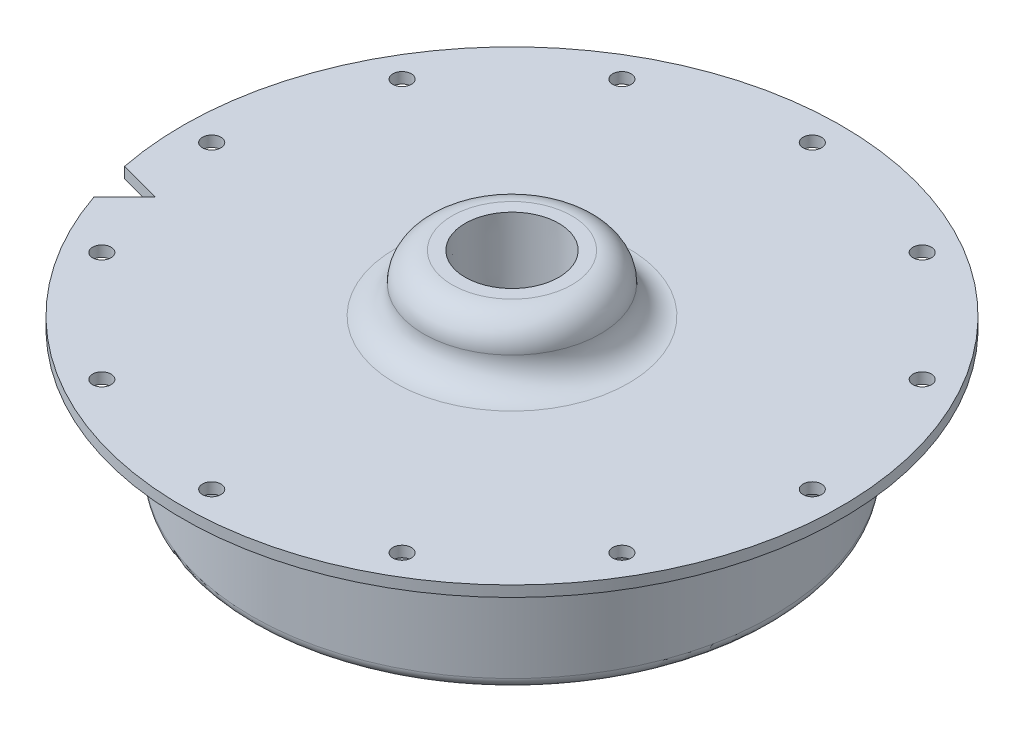
ISO-10303-21;
HEADER;
FILE_DESCRIPTION(('STEP AP214'),'2;1');
FILE_NAME('part.step','',(''),(''),'','','');
FILE_SCHEMA(('AUTOMOTIVE_DESIGN { 1 0 10303 214 1 1 1 1 }'));
ENDSEC;
DATA;
#1=APPLICATION_CONTEXT('core data for automotive mechanical design processes');
#2=APPLICATION_PROTOCOL_DEFINITION('international standard','automotive_design',2000,#1);
#3=PRODUCT_CONTEXT('',#1,'mechanical');
#4=PRODUCT('Part','Part','',(#3));
#5=PRODUCT_RELATED_PRODUCT_CATEGORY('part','',(#4));
#6=PRODUCT_DEFINITION_FORMATION('','',#4);
#7=PRODUCT_DEFINITION_CONTEXT('part definition',#1,'design');
#8=PRODUCT_DEFINITION('design','',#6,#7);
#9=PRODUCT_DEFINITION_SHAPE('','',#8);
#10=(LENGTH_UNIT() NAMED_UNIT(*) SI_UNIT(.MILLI.,.METRE.));
#11=(NAMED_UNIT(*) PLANE_ANGLE_UNIT() SI_UNIT($,.RADIAN.));
#12=(NAMED_UNIT(*) SI_UNIT($,.STERADIAN.) SOLID_ANGLE_UNIT());
#13=UNCERTAINTY_MEASURE_WITH_UNIT(LENGTH_MEASURE(1.E-05),#10,'distance_accuracy_value','');
#14=(GEOMETRIC_REPRESENTATION_CONTEXT(3) GLOBAL_UNCERTAINTY_ASSIGNED_CONTEXT((#13)) GLOBAL_UNIT_ASSIGNED_CONTEXT((#10,
#11,#12)) REPRESENTATION_CONTEXT('',''));
#15=CARTESIAN_POINT('',(0.,0.,0.));
#16=DIRECTION('',(0.,0.,1.));
#17=DIRECTION('',(1.,0.,0.));
#18=AXIS2_PLACEMENT_3D('',#15,#16,#17);
#19=CARTESIAN_POINT('',(0.,55.,0.));
#20=DIRECTION('',(0.,1.,0.));
#21=DIRECTION('',(0.,0.,1.));
#22=AXIS2_PLACEMENT_3D('',#19,#20,#21);
#23=CYLINDRICAL_SURFACE('',#22,48.26);
#24=DIRECTION('',(0.,1.,0.));
#25=VECTOR('',#24,1.);
#26=CARTESIAN_POINT('',(-47.3363393913495,-8.67426131403117,9.39673203975569));
#27=LINE('',#26,#25);
#28=CARTESIAN_POINT('',(-47.3363393913495,0.,9.39673203975569));
#29=VERTEX_POINT('',#28);
#30=CARTESIAN_POINT('',(-47.3363393913495,1.5875,9.39673203975569));
#31=VERTEX_POINT('',#30);
#32=EDGE_CURVE('E67',#29,#31,#27,.T.);
#33=ORIENTED_EDGE('',*,*,#32,.T.);
#34=CARTESIAN_POINT('',(0.,1.5875,0.));
#35=DIRECTION('',(0.,1.,0.));
#36=DIRECTION('',(0.,0.,1.));
#37=AXIS2_PLACEMENT_3D('',#34,#35,#36);
#38=CIRCLE('',#37,48.26);
#39=CARTESIAN_POINT('',(-45.6928384549485,1.5875,15.5303610366912));
#40=VERTEX_POINT('',#39);
#41=EDGE_CURVE('E82',#40,#31,#38,.T.);
#42=ORIENTED_EDGE('',*,*,#41,.F.);
#43=DIRECTION('',(0.,1.,0.));
#44=VECTOR('',#43,1.);
#45=CARTESIAN_POINT('',(-45.6928384549485,-8.67426131403117,15.5303610366912));
#46=LINE('',#45,#44);
#47=CARTESIAN_POINT('',(-45.6928384549485,0.,15.5303610366912));
#48=VERTEX_POINT('',#47);
#49=EDGE_CURVE('E47',#48,#40,#46,.T.);
#50=ORIENTED_EDGE('',*,*,#49,.F.);
#51=CARTESIAN_POINT('',(0.,0.,0.));
#52=DIRECTION('',(0.,1.,0.));
#53=DIRECTION('',(0.,0.,1.));
#54=AXIS2_PLACEMENT_3D('',#51,#52,#53);
#55=CIRCLE('',#54,48.26);
#56=EDGE_CURVE('E11',#48,#29,#55,.T.);
#57=ORIENTED_EDGE('',*,*,#56,.T.);
#58=EDGE_LOOP('',(#33,#42,#50,#57));
#59=FACE_BOUND('',#58,.T.);
#60=ADVANCED_FACE('F33',(#59),#23,.T.);
#61=CARTESIAN_POINT('',(-48.26,0.,0.));
#62=DIRECTION('',(0.,-1.,0.));
#63=DIRECTION('',(0.,0.,-1.));
#64=AXIS2_PLACEMENT_3D('',#61,#62,#63);
#65=PLANE('',#64);
#66=DIRECTION('',(-0.965925826289069,0.,-0.258819045102518));
#67=VECTOR('',#66,1.);
#68=CARTESIAN_POINT('',(-5.52011648807824,0.,20.6013551972069));
#69=LINE('',#68,#67);
#70=CARTESIAN_POINT('',(-41.2027103944139,0.,11.0402329761567));
#71=VERTEX_POINT('',#70);
#72=EDGE_CURVE('E65',#71,#29,#69,.T.);
#73=ORIENTED_EDGE('',*,*,#72,.T.);
#74=ORIENTED_EDGE('',*,*,#56,.F.);
#75=DIRECTION('',(0.707106781186549,0.,-0.707106781186547));
#76=VECTOR('',#75,1.);
#77=CARTESIAN_POINT('',(-15.0812387091286,0.,-15.0812387091286));
#78=LINE('',#77,#76);
#79=EDGE_CURVE('E80',#48,#71,#78,.T.);
#80=ORIENTED_EDGE('',*,*,#79,.T.);
#81=EDGE_LOOP('',(#73,#74,#80));
#82=FACE_BOUND('',#81,.T.);
#83=CARTESIAN_POINT('',(-38.0823845996807,0.,-21.9868749999744));
#84=DIRECTION('',(0.,-1.,0.));
#85=DIRECTION('',(0.,0.,-1.));
#86=AXIS2_PLACEMENT_3D('',#83,#84,#85);
#87=CIRCLE('',#86,1.35254999999999);
#88=CARTESIAN_POINT('',(-38.0823845996807,0.,-23.3394249999744));
#89=VERTEX_POINT('',#88);
#90=EDGE_CURVE('E96',#89,#89,#87,.T.);
#91=ORIENTED_EDGE('',*,*,#90,.F.);
#92=EDGE_LOOP('',(#91));
#93=FACE_BOUND('',#92,.T.);
#94=CARTESIAN_POINT('',(-21.9868750000255,0.,-38.0823845996512));
#95=DIRECTION('',(0.,-1.,0.));
#96=DIRECTION('',(0.,0.,-1.));
#97=AXIS2_PLACEMENT_3D('',#94,#95,#96);
#98=CIRCLE('',#97,1.35254999999999);
#99=CARTESIAN_POINT('',(-21.9868750000255,0.,-39.4349345996512));
#100=VERTEX_POINT('',#99);
#101=EDGE_CURVE('E102',#100,#100,#98,.T.);
#102=ORIENTED_EDGE('',*,*,#101,.F.);
#103=EDGE_LOOP('',(#102));
#104=FACE_BOUND('',#103,.T.);
#105=CARTESIAN_POINT('',(-2.94188747273289E-11,0.,-43.97375));
#106=DIRECTION('',(0.,-1.,0.));
#107=DIRECTION('',(0.,0.,-1.));
#108=AXIS2_PLACEMENT_3D('',#105,#106,#107);
#109=CIRCLE('',#108,1.35254999999999);
#110=CARTESIAN_POINT('',(-2.94188747273289E-11,0.,-45.3263));
#111=VERTEX_POINT('',#110);
#112=EDGE_CURVE('E108',#111,#111,#109,.T.);
#113=ORIENTED_EDGE('',*,*,#112,.F.);
#114=EDGE_LOOP('',(#113));
#115=FACE_BOUND('',#114,.T.);
#116=CARTESIAN_POINT('',(21.9868749999746,0.,-38.0823845996806));
#117=DIRECTION('',(0.,-1.,0.));
#118=DIRECTION('',(0.,0.,-1.));
#119=AXIS2_PLACEMENT_3D('',#116,#117,#118);
#120=CIRCLE('',#119,1.35254999999999);
#121=CARTESIAN_POINT('',(21.9868749999746,0.,-39.4349345996806));
#122=VERTEX_POINT('',#121);
#123=EDGE_CURVE('E114',#122,#122,#120,.T.);
#124=ORIENTED_EDGE('',*,*,#123,.F.);
#125=EDGE_LOOP('',(#124));
#126=FACE_BOUND('',#125,.T.);
#127=CARTESIAN_POINT('',(38.0823845996513,0.,-21.9868750000254));
#128=DIRECTION('',(0.,-1.,0.));
#129=DIRECTION('',(0.,0.,-1.));
#130=AXIS2_PLACEMENT_3D('',#127,#128,#129);
#131=CIRCLE('',#130,1.35254999999999);
#132=CARTESIAN_POINT('',(38.0823845996513,0.,-23.3394250000254));
#133=VERTEX_POINT('',#132);
#134=EDGE_CURVE('E120',#133,#133,#131,.T.);
#135=ORIENTED_EDGE('',*,*,#134,.F.);
#136=EDGE_LOOP('',(#135));
#137=FACE_BOUND('',#136,.T.);
#138=CARTESIAN_POINT('',(43.97375,0.,-2.89527314181316E-11));
#139=DIRECTION('',(0.,-1.,0.));
#140=DIRECTION('',(0.,0.,-1.));
#141=AXIS2_PLACEMENT_3D('',#138,#139,#140);
#142=CIRCLE('',#141,1.35254999999999);
#143=CARTESIAN_POINT('',(43.97375,0.,-1.35255000002894));
#144=VERTEX_POINT('',#143);
#145=EDGE_CURVE('E126',#144,#144,#142,.T.);
#146=ORIENTED_EDGE('',*,*,#145,.F.);
#147=EDGE_LOOP('',(#146));
#148=FACE_BOUND('',#147,.T.);
#149=CARTESIAN_POINT('',(38.0823845996805,0.,21.9868749999747));
#150=DIRECTION('',(0.,-1.,0.));
#151=DIRECTION('',(0.,0.,-1.));
#152=AXIS2_PLACEMENT_3D('',#149,#150,#151);
#153=CIRCLE('',#152,1.35254999999999);
#154=CARTESIAN_POINT('',(38.0823845996805,0.,20.6343249999747));
#155=VERTEX_POINT('',#154);
#156=EDGE_CURVE('E132',#155,#155,#153,.T.);
#157=ORIENTED_EDGE('',*,*,#156,.F.);
#158=EDGE_LOOP('',(#157));
#159=FACE_BOUND('',#158,.T.);
#160=CARTESIAN_POINT('',(21.9868750000252,0.,38.0823845996514));
#161=DIRECTION('',(0.,-1.,0.));
#162=DIRECTION('',(0.,0.,-1.));
#163=AXIS2_PLACEMENT_3D('',#160,#161,#162);
#164=CIRCLE('',#163,1.35254999999999);
#165=CARTESIAN_POINT('',(21.9868750000252,0.,36.7298345996514));
#166=VERTEX_POINT('',#165);
#167=EDGE_CURVE('E138',#166,#166,#164,.T.);
#168=ORIENTED_EDGE('',*,*,#167,.F.);
#169=EDGE_LOOP('',(#168));
#170=FACE_BOUND('',#169,.T.);
#171=CARTESIAN_POINT('',(2.91007222190302E-11,0.,43.97375));
#172=DIRECTION('',(0.,-1.,0.));
#173=DIRECTION('',(0.,0.,-1.));
#174=AXIS2_PLACEMENT_3D('',#171,#172,#173);
#175=CIRCLE('',#174,1.35254999999999);
#176=CARTESIAN_POINT('',(2.91007222190302E-11,0.,42.6212));
#177=VERTEX_POINT('',#176);
#178=EDGE_CURVE('E144',#177,#177,#175,.T.);
#179=ORIENTED_EDGE('',*,*,#178,.F.);
#180=EDGE_LOOP('',(#179));
#181=FACE_BOUND('',#180,.T.);
#182=CARTESIAN_POINT('',(-21.9868749999748,0.,38.0823845996805));
#183=DIRECTION('',(0.,-1.,0.));
#184=DIRECTION('',(0.,0.,-1.));
#185=AXIS2_PLACEMENT_3D('',#182,#183,#184);
#186=CIRCLE('',#185,1.35254999999999);
#187=CARTESIAN_POINT('',(-21.9868749999748,0.,36.7298345996805));
#188=VERTEX_POINT('',#187);
#189=EDGE_CURVE('E150',#188,#188,#186,.T.);
#190=ORIENTED_EDGE('',*,*,#189,.F.);
#191=EDGE_LOOP('',(#190));
#192=FACE_BOUND('',#191,.T.);
#193=CARTESIAN_POINT('',(-38.0823845996514,0.,21.9868750000251));
#194=DIRECTION('',(0.,-1.,0.));
#195=DIRECTION('',(0.,0.,-1.));
#196=AXIS2_PLACEMENT_3D('',#193,#194,#195);
#197=CIRCLE('',#196,1.35254999999999);
#198=CARTESIAN_POINT('',(-38.0823845996514,0.,20.6343250000251));
#199=VERTEX_POINT('',#198);
#200=EDGE_CURVE('E156',#199,#199,#197,.T.);
#201=ORIENTED_EDGE('',*,*,#200,.F.);
#202=EDGE_LOOP('',(#201));
#203=FACE_BOUND('',#202,.T.);
#204=CARTESIAN_POINT('',(-43.97375,0.,2.89527314181316E-11));
#205=DIRECTION('',(0.,-1.,0.));
#206=DIRECTION('',(0.,0.,-1.));
#207=AXIS2_PLACEMENT_3D('',#204,#205,#206);
#208=CIRCLE('',#207,1.35254999999999);
#209=CARTESIAN_POINT('',(-43.97375,0.,-1.35254999997104));
#210=VERTEX_POINT('',#209);
#211=EDGE_CURVE('E162',#210,#210,#208,.T.);
#212=ORIENTED_EDGE('',*,*,#211,.F.);
#213=EDGE_LOOP('',(#212));
#214=FACE_BOUND('',#213,.T.);
#215=CARTESIAN_POINT('',(0.,0.,0.));
#216=DIRECTION('',(0.,1.,0.));
#217=DIRECTION('',(0.,0.,1.));
#218=AXIS2_PLACEMENT_3D('',#215,#216,#217);
#219=CIRCLE('',#218,39.6874999999754);
#220=CARTESIAN_POINT('',(0.,0.,39.6874999999754));
#221=VERTEX_POINT('',#220);
#222=EDGE_CURVE('E40',#221,#221,#219,.T.);
#223=ORIENTED_EDGE('',*,*,#222,.T.);
#224=EDGE_LOOP('',(#223));
#225=FACE_BOUND('',#224,.T.);
#226=ADVANCED_FACE('F78',(#82,#93,#104,#115,#126,#137,#148,#159,#170,#181,#192,#203,#214,#225),
#65,.T.);
#227=CARTESIAN_POINT('',(0.,-1.5875,0.));
#228=DIRECTION('',(0.,1.,0.));
#229=DIRECTION('',(0.,0.,1.));
#230=AXIS2_PLACEMENT_3D('',#227,#228,#229);
#231=TOROIDAL_SURFACE('',#230,39.6874999999754,1.5875);
#232=CARTESIAN_POINT('',(0.,-1.5875,0.));
#233=DIRECTION('',(0.,1.,0.));
#234=DIRECTION('',(0.,0.,1.));
#235=AXIS2_PLACEMENT_3D('',#232,#233,#234);
#236=CIRCLE('',#235,38.0999999999754);
#237=CARTESIAN_POINT('',(0.,-1.5875,38.0999999999754));
#238=VERTEX_POINT('',#237);
#239=EDGE_CURVE('E187',#238,#238,#236,.T.);
#240=ORIENTED_EDGE('',*,*,#239,.T.);
#241=EDGE_LOOP('',(#240));
#242=FACE_BOUND('',#241,.T.);
#243=ORIENTED_EDGE('',*,*,#222,.F.);
#244=EDGE_LOOP('',(#243));
#245=FACE_BOUND('',#244,.T.);
#246=ADVANCED_FACE('F193',(#242,#245),#231,.F.);
#247=CARTESIAN_POINT('',(0.,55.,0.));
#248=DIRECTION('',(0.,1.,0.));
#249=DIRECTION('',(0.,0.,1.));
#250=AXIS2_PLACEMENT_3D('',#247,#248,#249);
#251=CYLINDRICAL_SURFACE('',#250,38.0999999999754);
#252=CARTESIAN_POINT('',(0.,-17.4625,0.));
#253=DIRECTION('',(0.,1.,0.));
#254=DIRECTION('',(0.,0.,1.));
#255=AXIS2_PLACEMENT_3D('',#252,#253,#254);
#256=CIRCLE('',#255,38.0999999999754);
#257=CARTESIAN_POINT('',(0.,-17.4625,38.0999999999754));
#258=VERTEX_POINT('',#257);
#259=EDGE_CURVE('E184',#258,#258,#256,.T.);
#260=ORIENTED_EDGE('',*,*,#259,.T.);
#261=EDGE_LOOP('',(#260));
#262=FACE_BOUND('',#261,.T.);
#263=ORIENTED_EDGE('',*,*,#239,.F.);
#264=EDGE_LOOP('',(#263));
#265=FACE_BOUND('',#264,.T.);
#266=ADVANCED_FACE('F195',(#262,#265),#251,.T.);
#267=CARTESIAN_POINT('',(0.,-17.4625,0.));
#268=DIRECTION('',(0.,1.,0.));
#269=DIRECTION('',(0.,0.,1.));
#270=AXIS2_PLACEMENT_3D('',#267,#268,#269);
#271=TOROIDAL_SURFACE('',#270,36.5124999999754,1.5875);
#272=CARTESIAN_POINT('',(0.,-17.4625,0.));
#273=DIRECTION('',(0.,1.,0.));
#274=DIRECTION('',(0.,0.,1.));
#275=AXIS2_PLACEMENT_3D('',#272,#273,#274);
#276=CIRCLE('',#275,34.9249999999754);
#277=CARTESIAN_POINT('',(0.,-17.4625,34.9249999999754));
#278=VERTEX_POINT('',#277);
#279=EDGE_CURVE('E181',#278,#278,#276,.T.);
#280=ORIENTED_EDGE('',*,*,#279,.T.);
#281=EDGE_LOOP('',(#280));
#282=FACE_BOUND('',#281,.T.);
#283=ORIENTED_EDGE('',*,*,#259,.F.);
#284=EDGE_LOOP('',(#283));
#285=FACE_BOUND('',#284,.T.);
#286=ADVANCED_FACE('F202',(#282,#285),#271,.T.);
#287=CARTESIAN_POINT('',(0.,55.,0.));
#288=DIRECTION('',(0.,1.,0.));
#289=DIRECTION('',(0.,0.,1.));
#290=AXIS2_PLACEMENT_3D('',#287,#288,#289);
#291=CYLINDRICAL_SURFACE('',#290,34.9249999999754);
#292=CARTESIAN_POINT('',(0.,-3.175,0.));
#293=DIRECTION('',(0.,1.,0.));
#294=DIRECTION('',(0.,0.,1.));
#295=AXIS2_PLACEMENT_3D('',#292,#293,#294);
#296=CIRCLE('',#295,34.9249999999754);
#297=CARTESIAN_POINT('',(0.,-3.175,34.9249999999754));
#298=VERTEX_POINT('',#297);
#299=EDGE_CURVE('E178',#298,#298,#296,.T.);
#300=ORIENTED_EDGE('',*,*,#299,.T.);
#301=EDGE_LOOP('',(#300));
#302=FACE_BOUND('',#301,.T.);
#303=ORIENTED_EDGE('',*,*,#279,.F.);
#304=EDGE_LOOP('',(#303));
#305=FACE_BOUND('',#304,.T.);
#306=ADVANCED_FACE('F320',(#302,#305),#291,.F.);
#307=CARTESIAN_POINT('',(0.,-3.175,0.));
#308=DIRECTION('',(0.,1.,0.));
#309=DIRECTION('',(0.,0.,1.));
#310=AXIS2_PLACEMENT_3D('',#307,#308,#309);
#311=TOROIDAL_SURFACE('',#310,31.7499999999754,3.17499999999999);
#312=CARTESIAN_POINT('',(0.,0.,0.));
#313=DIRECTION('',(0.,1.,0.));
#314=DIRECTION('',(0.,0.,1.));
#315=AXIS2_PLACEMENT_3D('',#312,#313,#314);
#316=CIRCLE('',#315,31.7499999999754);
#317=CARTESIAN_POINT('',(0.,0.,31.7499999999754));
#318=VERTEX_POINT('',#317);
#319=EDGE_CURVE('E175',#318,#318,#316,.T.);
#320=ORIENTED_EDGE('',*,*,#319,.T.);
#321=EDGE_LOOP('',(#320));
#322=FACE_BOUND('',#321,.T.);
#323=ORIENTED_EDGE('',*,*,#299,.F.);
#324=EDGE_LOOP('',(#323));
#325=FACE_BOUND('',#324,.T.);
#326=ADVANCED_FACE('F316',(#322,#325),#311,.F.);
#327=CARTESIAN_POINT('',(-31.7499999999754,0.,0.));
#328=DIRECTION('',(0.,-1.,0.));
#329=DIRECTION('',(0.,0.,-1.));
#330=AXIS2_PLACEMENT_3D('',#327,#328,#329);
#331=PLANE('',#330);
#332=CARTESIAN_POINT('',(0.,0.,0.));
#333=DIRECTION('',(0.,1.,0.));
#334=DIRECTION('',(0.,0.,1.));
#335=AXIS2_PLACEMENT_3D('',#332,#333,#334);
#336=CIRCLE('',#335,6.55798479417671);
#337=CARTESIAN_POINT('',(0.,0.,6.55798479417671));
#338=VERTEX_POINT('',#337);
#339=EDGE_CURVE('E90',#338,#338,#336,.T.);
#340=ORIENTED_EDGE('',*,*,#339,.T.);
#341=EDGE_LOOP('',(#340));
#342=FACE_BOUND('',#341,.T.);
#343=ORIENTED_EDGE('',*,*,#319,.F.);
#344=EDGE_LOOP('',(#343));
#345=FACE_BOUND('',#344,.T.);
#346=ADVANCED_FACE('F312',(#342,#345),#331,.T.);
#347=CARTESIAN_POINT('',(-5.588,9.906,0.));
#348=DIRECTION('',(0.,1.,0.));
#349=DIRECTION('',(0.,0.,1.));
#350=AXIS2_PLACEMENT_3D('',#347,#348,#349);
#351=PLANE('',#350);
#352=CARTESIAN_POINT('',(0.,9.906,0.));
#353=DIRECTION('',(0.,1.,0.));
#354=DIRECTION('',(0.,0.,1.));
#355=AXIS2_PLACEMENT_3D('',#352,#353,#354);
#356=CIRCLE('',#355,6.8545837);
#357=CARTESIAN_POINT('',(0.,9.906,6.8545837));
#358=VERTEX_POINT('',#357);
#359=EDGE_CURVE('E87',#358,#358,#356,.T.);
#360=ORIENTED_EDGE('',*,*,#359,.F.);
#361=EDGE_LOOP('',(#360));
#362=FACE_BOUND('',#361,.T.);
#363=CARTESIAN_POINT('',(0.,9.906,0.));
#364=DIRECTION('',(0.,1.,0.));
#365=DIRECTION('',(0.,0.,1.));
#366=AXIS2_PLACEMENT_3D('',#363,#364,#365);
#367=CIRCLE('',#366,8.763);
#368=CARTESIAN_POINT('',(0.,9.906,8.763));
#369=VERTEX_POINT('',#368);
#370=EDGE_CURVE('E172',#369,#369,#367,.T.);
#371=ORIENTED_EDGE('',*,*,#370,.T.);
#372=EDGE_LOOP('',(#371));
#373=FACE_BOUND('',#372,.T.);
#374=ADVANCED_FACE('F308',(#362,#373),#351,.T.);
#375=CARTESIAN_POINT('',(0.,5.74675,0.));
#376=DIRECTION('',(0.,1.,0.));
#377=DIRECTION('',(0.,0.,1.));
#378=AXIS2_PLACEMENT_3D('',#375,#376,#377);
#379=TOROIDAL_SURFACE('',#378,8.763,4.15925);
#380=CARTESIAN_POINT('',(0.,5.74675,0.));
#381=DIRECTION('',(0.,1.,0.));
#382=DIRECTION('',(0.,0.,1.));
#383=AXIS2_PLACEMENT_3D('',#380,#381,#382);
#384=CIRCLE('',#383,12.92225);
#385=CARTESIAN_POINT('',(0.,5.74675,12.92225));
#386=VERTEX_POINT('',#385);
#387=EDGE_CURVE('E169',#386,#386,#384,.T.);
#388=ORIENTED_EDGE('',*,*,#387,.T.);
#389=EDGE_LOOP('',(#388));
#390=FACE_BOUND('',#389,.T.);
#391=ORIENTED_EDGE('',*,*,#370,.F.);
#392=EDGE_LOOP('',(#391));
#393=FACE_BOUND('',#392,.T.);
#394=ADVANCED_FACE('F304',(#390,#393),#379,.T.);
#395=CARTESIAN_POINT('',(0.,5.74675,0.));
#396=DIRECTION('',(0.,1.,0.));
#397=DIRECTION('',(0.,0.,1.));
#398=AXIS2_PLACEMENT_3D('',#395,#396,#397);
#399=TOROIDAL_SURFACE('',#398,17.0815,4.15925);
#400=CARTESIAN_POINT('',(0.,1.5875,0.));
#401=DIRECTION('',(0.,1.,0.));
#402=DIRECTION('',(0.,0.,1.));
#403=AXIS2_PLACEMENT_3D('',#400,#401,#402);
#404=CIRCLE('',#403,17.0815);
#405=CARTESIAN_POINT('',(0.,1.5875,17.0815));
#406=VERTEX_POINT('',#405);
#407=EDGE_CURVE('E166',#406,#406,#404,.T.);
#408=ORIENTED_EDGE('',*,*,#407,.T.);
#409=EDGE_LOOP('',(#408));
#410=FACE_BOUND('',#409,.T.);
#411=ORIENTED_EDGE('',*,*,#387,.F.);
#412=EDGE_LOOP('',(#411));
#413=FACE_BOUND('',#412,.T.);
#414=ADVANCED_FACE('F225',(#410,#413),#399,.F.);
#415=CARTESIAN_POINT('',(-48.26,1.5875,0.));
#416=DIRECTION('',(0.,1.,0.));
#417=DIRECTION('',(0.,0.,1.));
#418=AXIS2_PLACEMENT_3D('',#415,#416,#417);
#419=PLANE('',#418);
#420=DIRECTION('',(-0.965925826289069,0.,-0.258819045102518));
#421=VECTOR('',#420,1.);
#422=CARTESIAN_POINT('',(-5.52011648807824,1.5875,20.6013551972069));
#423=LINE('',#422,#421);
#424=CARTESIAN_POINT('',(-41.2027103944139,1.5875,11.0402329761567));
#425=VERTEX_POINT('',#424);
#426=EDGE_CURVE('E70',#425,#31,#423,.T.);
#427=ORIENTED_EDGE('',*,*,#426,.F.);
#428=DIRECTION('',(0.707106781186548,0.,-0.707106781186547));
#429=VECTOR('',#428,1.);
#430=CARTESIAN_POINT('',(-15.0812387091286,1.5875,-15.0812387091286));
#431=LINE('',#430,#429);
#432=EDGE_CURVE('E531',#40,#425,#431,.T.);
#433=ORIENTED_EDGE('',*,*,#432,.F.);
#434=ORIENTED_EDGE('',*,*,#41,.T.);
#435=EDGE_LOOP('',(#427,#433,#434));
#436=FACE_BOUND('',#435,.T.);
#437=CARTESIAN_POINT('',(-38.0823845996807,1.58750000000002,-21.9868749999744));
#438=DIRECTION('',(0.,1.,0.));
#439=DIRECTION('',(0.,0.,1.));
#440=AXIS2_PLACEMENT_3D('',#437,#438,#439);
#441=CIRCLE('',#440,1.35254999999999);
#442=CARTESIAN_POINT('',(-38.0823845996807,1.58750000000002,-20.6343249999744));
#443=VERTEX_POINT('',#442);
#444=EDGE_CURVE('E93',#443,#443,#441,.T.);
#445=ORIENTED_EDGE('',*,*,#444,.F.);
#446=EDGE_LOOP('',(#445));
#447=FACE_BOUND('',#446,.T.);
#448=CARTESIAN_POINT('',(-21.9868750000255,1.58750000000008,-38.0823845996512));
#449=DIRECTION('',(0.,1.,0.));
#450=DIRECTION('',(0.,0.,1.));
#451=AXIS2_PLACEMENT_3D('',#448,#449,#450);
#452=CIRCLE('',#451,1.35254999999999);
#453=CARTESIAN_POINT('',(-21.9868750000255,1.58750000000007,-36.7298345996512));
#454=VERTEX_POINT('',#453);
#455=EDGE_CURVE('E99',#454,#454,#452,.T.);
#456=ORIENTED_EDGE('',*,*,#455,.F.);
#457=EDGE_LOOP('',(#456));
#458=FACE_BOUND('',#457,.T.);
#459=CARTESIAN_POINT('',(-2.94188747273289E-11,1.58750000000015,-43.97375));
#460=DIRECTION('',(0.,1.,0.));
#461=DIRECTION('',(0.,0.,1.));
#462=AXIS2_PLACEMENT_3D('',#459,#460,#461);
#463=CIRCLE('',#462,1.35254999999999);
#464=CARTESIAN_POINT('',(-2.94188747273289E-11,1.58750000000015,-42.6212));
#465=VERTEX_POINT('',#464);
#466=EDGE_CURVE('E105',#465,#465,#463,.T.);
#467=ORIENTED_EDGE('',*,*,#466,.F.);
#468=EDGE_LOOP('',(#467));
#469=FACE_BOUND('',#468,.T.);
#470=CARTESIAN_POINT('',(21.9868749999746,1.58750000000023,-38.0823845996806));
#471=DIRECTION('',(0.,1.,0.));
#472=DIRECTION('',(0.,0.,1.));
#473=AXIS2_PLACEMENT_3D('',#470,#471,#472);
#474=CIRCLE('',#473,1.35254999999999);
#475=CARTESIAN_POINT('',(21.9868749999746,1.58750000000023,-36.7298345996806));
#476=VERTEX_POINT('',#475);
#477=EDGE_CURVE('E111',#476,#476,#474,.T.);
#478=ORIENTED_EDGE('',*,*,#477,.F.);
#479=EDGE_LOOP('',(#478));
#480=FACE_BOUND('',#479,.T.);
#481=CARTESIAN_POINT('',(38.0823845996513,1.58750000000029,-21.9868750000254));
#482=DIRECTION('',(0.,1.,0.));
#483=DIRECTION('',(0.,0.,1.));
#484=AXIS2_PLACEMENT_3D('',#481,#482,#483);
#485=CIRCLE('',#484,1.35254999999999);
#486=CARTESIAN_POINT('',(38.0823845996513,1.58750000000029,-20.6343250000254));
#487=VERTEX_POINT('',#486);
#488=EDGE_CURVE('E117',#487,#487,#485,.T.);
#489=ORIENTED_EDGE('',*,*,#488,.F.);
#490=EDGE_LOOP('',(#489));
#491=FACE_BOUND('',#490,.T.);
#492=CARTESIAN_POINT('',(43.97375,1.58750000000031,-2.89527314181316E-11));
#493=DIRECTION('',(0.,1.,0.));
#494=DIRECTION('',(0.,0.,1.));
#495=AXIS2_PLACEMENT_3D('',#492,#493,#494);
#496=CIRCLE('',#495,1.35254999999999);
#497=CARTESIAN_POINT('',(43.97375,1.58750000000031,1.35254999997103));
#498=VERTEX_POINT('',#497);
#499=EDGE_CURVE('E123',#498,#498,#496,.T.);
#500=ORIENTED_EDGE('',*,*,#499,.F.);
#501=EDGE_LOOP('',(#500));
#502=FACE_BOUND('',#501,.T.);
#503=CARTESIAN_POINT('',(38.0823845996805,1.58750000000029,21.9868749999747));
#504=DIRECTION('',(0.,1.,0.));
#505=DIRECTION('',(0.,0.,1.));
#506=AXIS2_PLACEMENT_3D('',#503,#504,#505);
#507=CIRCLE('',#506,1.35254999999999);
#508=CARTESIAN_POINT('',(38.0823845996805,1.58750000000029,23.3394249999747));
#509=VERTEX_POINT('',#508);
#510=EDGE_CURVE('E129',#509,#509,#507,.T.);
#511=ORIENTED_EDGE('',*,*,#510,.F.);
#512=EDGE_LOOP('',(#511));
#513=FACE_BOUND('',#512,.T.);
#514=CARTESIAN_POINT('',(21.9868750000252,1.58750000000023,38.0823845996514));
#515=DIRECTION('',(0.,1.,0.));
#516=DIRECTION('',(0.,0.,1.));
#517=AXIS2_PLACEMENT_3D('',#514,#515,#516);
#518=CIRCLE('',#517,1.35254999999999);
#519=CARTESIAN_POINT('',(21.9868750000252,1.58750000000024,39.4349345996513));
#520=VERTEX_POINT('',#519);
#521=EDGE_CURVE('E135',#520,#520,#518,.T.);
#522=ORIENTED_EDGE('',*,*,#521,.F.);
#523=EDGE_LOOP('',(#522));
#524=FACE_BOUND('',#523,.T.);
#525=CARTESIAN_POINT('',(2.91007222190302E-11,1.58750000000015,43.97375));
#526=DIRECTION('',(0.,1.,0.));
#527=DIRECTION('',(0.,0.,1.));
#528=AXIS2_PLACEMENT_3D('',#525,#526,#527);
#529=CIRCLE('',#528,1.35254999999999);
#530=CARTESIAN_POINT('',(2.91007222190302E-11,1.58750000000016,45.3263));
#531=VERTEX_POINT('',#530);
#532=EDGE_CURVE('E141',#531,#531,#529,.T.);
#533=ORIENTED_EDGE('',*,*,#532,.F.);
#534=EDGE_LOOP('',(#533));
#535=FACE_BOUND('',#534,.T.);
#536=CARTESIAN_POINT('',(-21.9868749999748,1.58750000000008,38.0823845996805));
#537=DIRECTION('',(0.,1.,0.));
#538=DIRECTION('',(0.,0.,1.));
#539=AXIS2_PLACEMENT_3D('',#536,#537,#538);
#540=CIRCLE('',#539,1.35254999999999);
#541=CARTESIAN_POINT('',(-21.9868749999748,1.58750000000008,39.4349345996804));
#542=VERTEX_POINT('',#541);
#543=EDGE_CURVE('E147',#542,#542,#540,.T.);
#544=ORIENTED_EDGE('',*,*,#543,.F.);
#545=EDGE_LOOP('',(#544));
#546=FACE_BOUND('',#545,.T.);
#547=CARTESIAN_POINT('',(-38.0823845996514,1.58750000000002,21.9868750000251));
#548=DIRECTION('',(0.,1.,0.));
#549=DIRECTION('',(0.,0.,1.));
#550=AXIS2_PLACEMENT_3D('',#547,#548,#549);
#551=CIRCLE('',#550,1.35254999999999);
#552=CARTESIAN_POINT('',(-38.0823845996514,1.58750000000002,23.3394250000251));
#553=VERTEX_POINT('',#552);
#554=EDGE_CURVE('E153',#553,#553,#551,.T.);
#555=ORIENTED_EDGE('',*,*,#554,.F.);
#556=EDGE_LOOP('',(#555));
#557=FACE_BOUND('',#556,.T.);
#558=CARTESIAN_POINT('',(-43.97375,1.5875,2.89527314181316E-11));
#559=DIRECTION('',(0.,1.,0.));
#560=DIRECTION('',(0.,0.,1.));
#561=AXIS2_PLACEMENT_3D('',#558,#559,#560);
#562=CIRCLE('',#561,1.35254999999999);
#563=CARTESIAN_POINT('',(-43.97375,1.5875,1.35255000002894));
#564=VERTEX_POINT('',#563);
#565=EDGE_CURVE('E159',#564,#564,#562,.T.);
#566=ORIENTED_EDGE('',*,*,#565,.F.);
#567=EDGE_LOOP('',(#566));
#568=FACE_BOUND('',#567,.T.);
#569=ORIENTED_EDGE('',*,*,#407,.F.);
#570=EDGE_LOOP('',(#569));
#571=FACE_BOUND('',#570,.T.);
#572=ADVANCED_FACE('F219',(#436,#447,#458,#469,#480,#491,#502,#513,#524,#535,#546,#557,#568,
#571),#419,.T.);
#573=CARTESIAN_POINT('',(-43.97375,1.5875,2.89527314181316E-11));
#574=DIRECTION('',(0.,1.,0.));
#575=DIRECTION('',(0.,0.,1.));
#576=AXIS2_PLACEMENT_3D('',#573,#574,#575);
#577=CYLINDRICAL_SURFACE('',#576,1.35254999999999);
#578=ORIENTED_EDGE('',*,*,#211,.T.);
#579=EDGE_LOOP('',(#578));
#580=FACE_BOUND('',#579,.T.);
#581=ORIENTED_EDGE('',*,*,#565,.T.);
#582=EDGE_LOOP('',(#581));
#583=FACE_BOUND('',#582,.T.);
#584=ADVANCED_FACE('F224',(#580,#583),#577,.F.);
#585=CARTESIAN_POINT('',(-38.0823845996514,1.58750000000002,21.9868750000251));
#586=DIRECTION('',(0.,1.,0.));
#587=DIRECTION('',(0.,0.,1.));
#588=AXIS2_PLACEMENT_3D('',#585,#586,#587);
#589=CYLINDRICAL_SURFACE('',#588,1.35254999999999);
#590=ORIENTED_EDGE('',*,*,#200,.T.);
#591=EDGE_LOOP('',(#590));
#592=FACE_BOUND('',#591,.T.);
#593=ORIENTED_EDGE('',*,*,#554,.T.);
#594=EDGE_LOOP('',(#593));
#595=FACE_BOUND('',#594,.T.);
#596=ADVANCED_FACE('F296',(#592,#595),#589,.F.);
#597=CARTESIAN_POINT('',(-21.9868749999748,1.58750000000008,38.0823845996805));
#598=DIRECTION('',(0.,1.,0.));
#599=DIRECTION('',(0.,0.,1.));
#600=AXIS2_PLACEMENT_3D('',#597,#598,#599);
#601=CYLINDRICAL_SURFACE('',#600,1.35254999999999);
#602=ORIENTED_EDGE('',*,*,#189,.T.);
#603=EDGE_LOOP('',(#602));
#604=FACE_BOUND('',#603,.T.);
#605=ORIENTED_EDGE('',*,*,#543,.T.);
#606=EDGE_LOOP('',(#605));
#607=FACE_BOUND('',#606,.T.);
#608=ADVANCED_FACE('F292',(#604,#607),#601,.F.);
#609=CARTESIAN_POINT('',(2.91007222190302E-11,1.58750000000015,43.97375));
#610=DIRECTION('',(0.,1.,0.));
#611=DIRECTION('',(0.,0.,1.));
#612=AXIS2_PLACEMENT_3D('',#609,#610,#611);
#613=CYLINDRICAL_SURFACE('',#612,1.35254999999999);
#614=ORIENTED_EDGE('',*,*,#178,.T.);
#615=EDGE_LOOP('',(#614));
#616=FACE_BOUND('',#615,.T.);
#617=ORIENTED_EDGE('',*,*,#532,.T.);
#618=EDGE_LOOP('',(#617));
#619=FACE_BOUND('',#618,.T.);
#620=ADVANCED_FACE('F288',(#616,#619),#613,.F.);
#621=CARTESIAN_POINT('',(21.9868750000252,1.58750000000023,38.0823845996514));
#622=DIRECTION('',(0.,1.,0.));
#623=DIRECTION('',(0.,0.,1.));
#624=AXIS2_PLACEMENT_3D('',#621,#622,#623);
#625=CYLINDRICAL_SURFACE('',#624,1.35254999999999);
#626=ORIENTED_EDGE('',*,*,#167,.T.);
#627=EDGE_LOOP('',(#626));
#628=FACE_BOUND('',#627,.T.);
#629=ORIENTED_EDGE('',*,*,#521,.T.);
#630=EDGE_LOOP('',(#629));
#631=FACE_BOUND('',#630,.T.);
#632=ADVANCED_FACE('F284',(#628,#631),#625,.F.);
#633=CARTESIAN_POINT('',(38.0823845996805,1.58750000000029,21.9868749999747));
#634=DIRECTION('',(0.,1.,0.));
#635=DIRECTION('',(0.,0.,1.));
#636=AXIS2_PLACEMENT_3D('',#633,#634,#635);
#637=CYLINDRICAL_SURFACE('',#636,1.35254999999999);
#638=ORIENTED_EDGE('',*,*,#156,.T.);
#639=EDGE_LOOP('',(#638));
#640=FACE_BOUND('',#639,.T.);
#641=ORIENTED_EDGE('',*,*,#510,.T.);
#642=EDGE_LOOP('',(#641));
#643=FACE_BOUND('',#642,.T.);
#644=ADVANCED_FACE('F280',(#640,#643),#637,.F.);
#645=CARTESIAN_POINT('',(43.97375,1.58750000000031,-2.89527314181316E-11));
#646=DIRECTION('',(0.,1.,0.));
#647=DIRECTION('',(0.,0.,1.));
#648=AXIS2_PLACEMENT_3D('',#645,#646,#647);
#649=CYLINDRICAL_SURFACE('',#648,1.35254999999999);
#650=ORIENTED_EDGE('',*,*,#145,.T.);
#651=EDGE_LOOP('',(#650));
#652=FACE_BOUND('',#651,.T.);
#653=ORIENTED_EDGE('',*,*,#499,.T.);
#654=EDGE_LOOP('',(#653));
#655=FACE_BOUND('',#654,.T.);
#656=ADVANCED_FACE('F276',(#652,#655),#649,.F.);
#657=CARTESIAN_POINT('',(38.0823845996513,1.58750000000029,-21.9868750000254));
#658=DIRECTION('',(0.,1.,0.));
#659=DIRECTION('',(0.,0.,1.));
#660=AXIS2_PLACEMENT_3D('',#657,#658,#659);
#661=CYLINDRICAL_SURFACE('',#660,1.35254999999999);
#662=ORIENTED_EDGE('',*,*,#134,.T.);
#663=EDGE_LOOP('',(#662));
#664=FACE_BOUND('',#663,.T.);
#665=ORIENTED_EDGE('',*,*,#488,.T.);
#666=EDGE_LOOP('',(#665));
#667=FACE_BOUND('',#666,.T.);
#668=ADVANCED_FACE('F272',(#664,#667),#661,.F.);
#669=CARTESIAN_POINT('',(21.9868749999746,1.58750000000023,-38.0823845996806));
#670=DIRECTION('',(0.,1.,0.));
#671=DIRECTION('',(0.,0.,1.));
#672=AXIS2_PLACEMENT_3D('',#669,#670,#671);
#673=CYLINDRICAL_SURFACE('',#672,1.35254999999999);
#674=ORIENTED_EDGE('',*,*,#123,.T.);
#675=EDGE_LOOP('',(#674));
#676=FACE_BOUND('',#675,.T.);
#677=ORIENTED_EDGE('',*,*,#477,.T.);
#678=EDGE_LOOP('',(#677));
#679=FACE_BOUND('',#678,.T.);
#680=ADVANCED_FACE('F268',(#676,#679),#673,.F.);
#681=CARTESIAN_POINT('',(-2.94188747273289E-11,1.58750000000015,-43.97375));
#682=DIRECTION('',(0.,1.,0.));
#683=DIRECTION('',(0.,0.,1.));
#684=AXIS2_PLACEMENT_3D('',#681,#682,#683);
#685=CYLINDRICAL_SURFACE('',#684,1.35254999999999);
#686=ORIENTED_EDGE('',*,*,#112,.T.);
#687=EDGE_LOOP('',(#686));
#688=FACE_BOUND('',#687,.T.);
#689=ORIENTED_EDGE('',*,*,#466,.T.);
#690=EDGE_LOOP('',(#689));
#691=FACE_BOUND('',#690,.T.);
#692=ADVANCED_FACE('F264',(#688,#691),#685,.F.);
#693=CARTESIAN_POINT('',(-21.9868750000255,1.58750000000008,-38.0823845996512));
#694=DIRECTION('',(0.,1.,0.));
#695=DIRECTION('',(0.,0.,1.));
#696=AXIS2_PLACEMENT_3D('',#693,#694,#695);
#697=CYLINDRICAL_SURFACE('',#696,1.35254999999999);
#698=ORIENTED_EDGE('',*,*,#101,.T.);
#699=EDGE_LOOP('',(#698));
#700=FACE_BOUND('',#699,.T.);
#701=ORIENTED_EDGE('',*,*,#455,.T.);
#702=EDGE_LOOP('',(#701));
#703=FACE_BOUND('',#702,.T.);
#704=ADVANCED_FACE('F260',(#700,#703),#697,.F.);
#705=CARTESIAN_POINT('',(-38.0823845996807,1.58750000000002,-21.9868749999744));
#706=DIRECTION('',(0.,1.,0.));
#707=DIRECTION('',(0.,0.,1.));
#708=AXIS2_PLACEMENT_3D('',#705,#706,#707);
#709=CYLINDRICAL_SURFACE('',#708,1.35254999999999);
#710=ORIENTED_EDGE('',*,*,#90,.T.);
#711=EDGE_LOOP('',(#710));
#712=FACE_BOUND('',#711,.T.);
#713=ORIENTED_EDGE('',*,*,#444,.T.);
#714=EDGE_LOOP('',(#713));
#715=FACE_BOUND('',#714,.T.);
#716=ADVANCED_FACE('F256',(#712,#715),#709,.F.);
#717=CARTESIAN_POINT('',(0.,9.906,0.));
#718=DIRECTION('',(0.,1.,0.));
#719=DIRECTION('',(0.,0.,1.));
#720=AXIS2_PLACEMENT_3D('',#717,#718,#719);
#721=CONICAL_SURFACE('',#720,6.8545837,0.029932396671703);
#722=ORIENTED_EDGE('',*,*,#339,.F.);
#723=EDGE_LOOP('',(#722));
#724=FACE_BOUND('',#723,.T.);
#725=ORIENTED_EDGE('',*,*,#359,.T.);
#726=EDGE_LOOP('',(#725));
#727=FACE_BOUND('',#726,.T.);
#728=ADVANCED_FACE('F240',(#724,#727),#721,.F.);
#729=CARTESIAN_POINT('',(-5.52011648807824,-8.67426131403117,20.6013551972069));
#730=DIRECTION('',(0.258819045102518,0.,-0.965925826289069));
#731=DIRECTION('',(-0.965925826289069,0.,-0.258819045102518));
#732=AXIS2_PLACEMENT_3D('',#729,#730,#731);
#733=PLANE('',#732);
#734=DIRECTION('',(0.,1.,0.));
#735=VECTOR('',#734,1.);
#736=CARTESIAN_POINT('',(-41.2027103944139,-8.67426131403117,11.0402329761567));
#737=LINE('',#736,#735);
#738=EDGE_CURVE('E56',#71,#425,#737,.T.);
#739=ORIENTED_EDGE('',*,*,#738,.T.);
#740=ORIENTED_EDGE('',*,*,#426,.T.);
#741=ORIENTED_EDGE('',*,*,#32,.F.);
#742=ORIENTED_EDGE('',*,*,#72,.F.);
#743=EDGE_LOOP('',(#739,#740,#741,#742));
#744=FACE_BOUND('',#743,.T.);
#745=ADVANCED_FACE('F68',(#744),#733,.F.);
#746=CARTESIAN_POINT('',(-15.0812387091286,-8.67426131403117,-15.0812387091286));
#747=DIRECTION('',(0.707106781186547,0.,0.707106781186549));
#748=DIRECTION('',(0.707106781186549,0.,-0.707106781186547));
#749=AXIS2_PLACEMENT_3D('',#746,#747,#748);
#750=PLANE('',#749);
#751=ORIENTED_EDGE('',*,*,#49,.T.);
#752=ORIENTED_EDGE('',*,*,#432,.T.);
#753=ORIENTED_EDGE('',*,*,#738,.F.);
#754=ORIENTED_EDGE('',*,*,#79,.F.);
#755=EDGE_LOOP('',(#751,#752,#753,#754));
#756=FACE_BOUND('',#755,.T.);
#757=ADVANCED_FACE('F239',(#756),#750,.F.);
#758=CLOSED_SHELL('',(#60,#226,#246,#266,#286,#306,#326,#346,#374,#394,#414,#572,#584,#596,#608,
#620,#632,#644,#656,#668,#680,#692,#704,#716,#728,#745,#757));
#759=MANIFOLD_SOLID_BREP('B2',#758);
#760=ADVANCED_BREP_SHAPE_REPRESENTATION('',(#18,#759),#14);
#761=SHAPE_DEFINITION_REPRESENTATION(#9,#760);
ENDSEC;
END-ISO-10303-21;
